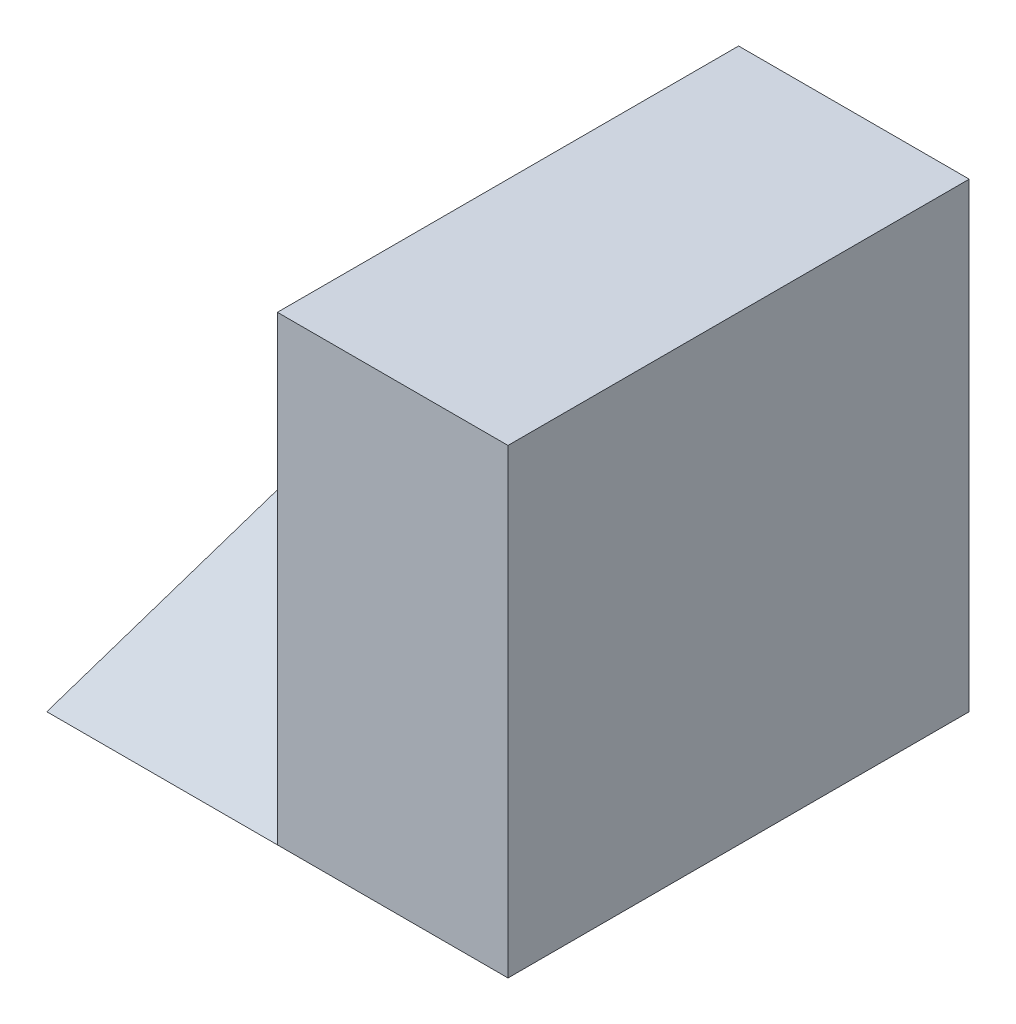
ISO-10303-21;
HEADER;
FILE_DESCRIPTION(('STEP AP214'),'2;1');
FILE_NAME('part.step','',(''),(''),'','','');
FILE_SCHEMA(('AUTOMOTIVE_DESIGN { 1 0 10303 214 1 1 1 1 }'));
ENDSEC;
DATA;
#1=APPLICATION_CONTEXT('core data for automotive mechanical design processes');
#2=APPLICATION_PROTOCOL_DEFINITION('international standard','automotive_design',2000,#1);
#3=PRODUCT_CONTEXT('',#1,'mechanical');
#4=PRODUCT('Part','Part','',(#3));
#5=PRODUCT_RELATED_PRODUCT_CATEGORY('part','',(#4));
#6=PRODUCT_DEFINITION_FORMATION('','',#4);
#7=PRODUCT_DEFINITION_CONTEXT('part definition',#1,'design');
#8=PRODUCT_DEFINITION('design','',#6,#7);
#9=PRODUCT_DEFINITION_SHAPE('','',#8);
#10=(LENGTH_UNIT() NAMED_UNIT(*) SI_UNIT(.MILLI.,.METRE.));
#11=(NAMED_UNIT(*) PLANE_ANGLE_UNIT() SI_UNIT($,.RADIAN.));
#12=(NAMED_UNIT(*) SI_UNIT($,.STERADIAN.) SOLID_ANGLE_UNIT());
#13=UNCERTAINTY_MEASURE_WITH_UNIT(LENGTH_MEASURE(1.E-05),#10,'distance_accuracy_value','');
#14=(GEOMETRIC_REPRESENTATION_CONTEXT(3) GLOBAL_UNCERTAINTY_ASSIGNED_CONTEXT((#13)) GLOBAL_UNIT_ASSIGNED_CONTEXT((#10,
#11,#12)) REPRESENTATION_CONTEXT('',''));
#15=CARTESIAN_POINT('',(0.,0.,0.));
#16=DIRECTION('',(0.,0.,1.));
#17=DIRECTION('',(1.,0.,0.));
#18=AXIS2_PLACEMENT_3D('',#15,#16,#17);
#19=CARTESIAN_POINT('',(20.,40.,20.));
#20=DIRECTION('',(1.,0.,0.));
#21=DIRECTION('',(0.,0.,-1.));
#22=AXIS2_PLACEMENT_3D('',#19,#20,#21);
#23=PLANE('',#22);
#24=DIRECTION('',(0.,0.707106781186548,-0.707106781186548));
#25=VECTOR('',#24,1.);
#26=CARTESIAN_POINT('',(20.,40.,0.));
#27=LINE('',#26,#25);
#28=CARTESIAN_POINT('',(20.,0.,40.));
#29=VERTEX_POINT('',#28);
#30=CARTESIAN_POINT('',(20.,40.,0.));
#31=VERTEX_POINT('',#30);
#32=EDGE_CURVE('E93',#29,#31,#27,.T.);
#33=ORIENTED_EDGE('',*,*,#32,.F.);
#34=DIRECTION('',(0.,1.,0.));
#35=VECTOR('',#34,1.);
#36=CARTESIAN_POINT('',(20.,40.,40.));
#37=LINE('',#36,#35);
#38=CARTESIAN_POINT('',(20.,40.,40.));
#39=VERTEX_POINT('',#38);
#40=EDGE_CURVE('E108',#29,#39,#37,.T.);
#41=ORIENTED_EDGE('',*,*,#40,.T.);
#42=DIRECTION('',(0.,0.,1.));
#43=VECTOR('',#42,1.);
#44=CARTESIAN_POINT('',(20.,40.,0.));
#45=LINE('',#44,#43);
#46=EDGE_CURVE('E69',#31,#39,#45,.T.);
#47=ORIENTED_EDGE('',*,*,#46,.F.);
#48=EDGE_LOOP('',(#33,#41,#47));
#49=FACE_BOUND('',#48,.T.);
#50=ADVANCED_FACE('F33',(#49),#23,.F.);
#51=CARTESIAN_POINT('',(0.,0.,40.));
#52=DIRECTION('',(0.,1.,0.));
#53=DIRECTION('',(0.,0.,1.));
#54=AXIS2_PLACEMENT_3D('',#51,#52,#53);
#55=PLANE('',#54);
#56=DIRECTION('',(1.,0.,0.));
#57=VECTOR('',#56,1.);
#58=CARTESIAN_POINT('',(0.,0.,40.));
#59=LINE('',#58,#57);
#60=CARTESIAN_POINT('',(40.,0.,40.));
#61=VERTEX_POINT('',#60);
#62=EDGE_CURVE('E103',#29,#61,#59,.T.);
#63=ORIENTED_EDGE('',*,*,#62,.F.);
#64=DIRECTION('',(1.,0.,0.));
#65=VECTOR('',#64,1.);
#66=CARTESIAN_POINT('',(0.,0.,40.));
#67=LINE('',#66,#65);
#68=CARTESIAN_POINT('',(0.,0.,40.));
#69=VERTEX_POINT('',#68);
#70=EDGE_CURVE('E111',#69,#29,#67,.T.);
#71=ORIENTED_EDGE('',*,*,#70,.F.);
#72=DIRECTION('',(0.,0.,1.));
#73=VECTOR('',#72,1.);
#74=CARTESIAN_POINT('',(0.,0.,40.));
#75=LINE('',#74,#73);
#76=CARTESIAN_POINT('',(0.,0.,0.));
#77=VERTEX_POINT('',#76);
#78=EDGE_CURVE('E88',#77,#69,#75,.T.);
#79=ORIENTED_EDGE('',*,*,#78,.F.);
#80=DIRECTION('',(1.,0.,0.));
#81=VECTOR('',#80,1.);
#82=CARTESIAN_POINT('',(0.,0.,0.));
#83=LINE('',#82,#81);
#84=CARTESIAN_POINT('',(40.,0.,0.));
#85=VERTEX_POINT('',#84);
#86=EDGE_CURVE('E61',#77,#85,#83,.T.);
#87=ORIENTED_EDGE('',*,*,#86,.T.);
#88=DIRECTION('',(0.,0.,-1.));
#89=VECTOR('',#88,1.);
#90=CARTESIAN_POINT('',(40.,0.,40.));
#91=LINE('',#90,#89);
#92=EDGE_CURVE('E11',#61,#85,#91,.T.);
#93=ORIENTED_EDGE('',*,*,#92,.F.);
#94=EDGE_LOOP('',(#63,#71,#79,#87,#93));
#95=FACE_BOUND('',#94,.T.);
#96=ADVANCED_FACE('F35',(#95),#55,.F.);
#97=CARTESIAN_POINT('',(40.,0.,40.));
#98=DIRECTION('',(-1.,0.,0.));
#99=DIRECTION('',(0.,0.,1.));
#100=AXIS2_PLACEMENT_3D('',#97,#98,#99);
#101=PLANE('',#100);
#102=DIRECTION('',(0.,1.,0.));
#103=VECTOR('',#102,1.);
#104=CARTESIAN_POINT('',(40.,0.,0.));
#105=LINE('',#104,#103);
#106=CARTESIAN_POINT('',(40.,40.,0.));
#107=VERTEX_POINT('',#106);
#108=EDGE_CURVE('E104',#85,#107,#105,.T.);
#109=ORIENTED_EDGE('',*,*,#108,.T.);
#110=DIRECTION('',(0.,0.,-1.));
#111=VECTOR('',#110,1.);
#112=CARTESIAN_POINT('',(40.,40.,40.));
#113=LINE('',#112,#111);
#114=CARTESIAN_POINT('',(40.,40.,40.));
#115=VERTEX_POINT('',#114);
#116=EDGE_CURVE('E42',#115,#107,#113,.T.);
#117=ORIENTED_EDGE('',*,*,#116,.F.);
#118=DIRECTION('',(0.,1.,0.));
#119=VECTOR('',#118,1.);
#120=CARTESIAN_POINT('',(40.,0.,40.));
#121=LINE('',#120,#119);
#122=EDGE_CURVE('E50',#61,#115,#121,.T.);
#123=ORIENTED_EDGE('',*,*,#122,.F.);
#124=ORIENTED_EDGE('',*,*,#92,.T.);
#125=EDGE_LOOP('',(#109,#117,#123,#124));
#126=FACE_BOUND('',#125,.T.);
#127=ADVANCED_FACE('F123',(#126),#101,.F.);
#128=CARTESIAN_POINT('',(0.,40.,40.));
#129=DIRECTION('',(0.,-1.,0.));
#130=DIRECTION('',(0.,0.,-1.));
#131=AXIS2_PLACEMENT_3D('',#128,#129,#130);
#132=PLANE('',#131);
#133=DIRECTION('',(-1.,0.,0.));
#134=VECTOR('',#133,1.);
#135=CARTESIAN_POINT('',(0.,40.,0.));
#136=LINE('',#135,#134);
#137=EDGE_CURVE('E99',#107,#31,#136,.T.);
#138=ORIENTED_EDGE('',*,*,#137,.T.);
#139=ORIENTED_EDGE('',*,*,#46,.T.);
#140=DIRECTION('',(-1.,0.,0.));
#141=VECTOR('',#140,1.);
#142=CARTESIAN_POINT('',(0.,40.,40.));
#143=LINE('',#142,#141);
#144=EDGE_CURVE('E119',#115,#39,#143,.T.);
#145=ORIENTED_EDGE('',*,*,#144,.F.);
#146=ORIENTED_EDGE('',*,*,#116,.T.);
#147=EDGE_LOOP('',(#138,#139,#145,#146));
#148=FACE_BOUND('',#147,.T.);
#149=ADVANCED_FACE('F102',(#148),#132,.F.);
#150=CARTESIAN_POINT('',(0.,0.,40.));
#151=DIRECTION('',(0.,0.,-1.));
#152=DIRECTION('',(-1.,0.,0.));
#153=AXIS2_PLACEMENT_3D('',#150,#151,#152);
#154=PLANE('',#153);
#155=ORIENTED_EDGE('',*,*,#144,.T.);
#156=ORIENTED_EDGE('',*,*,#40,.F.);
#157=ORIENTED_EDGE('',*,*,#62,.T.);
#158=ORIENTED_EDGE('',*,*,#122,.T.);
#159=EDGE_LOOP('',(#155,#156,#157,#158));
#160=FACE_BOUND('',#159,.T.);
#161=ADVANCED_FACE('F125',(#160),#154,.F.);
#162=CARTESIAN_POINT('',(0.,0.,0.));
#163=DIRECTION('',(0.,0.,-1.));
#164=DIRECTION('',(-1.,0.,0.));
#165=AXIS2_PLACEMENT_3D('',#162,#163,#164);
#166=PLANE('',#165);
#167=DIRECTION('',(-0.447213595499958,-0.894427190999916,0.));
#168=VECTOR('',#167,1.);
#169=CARTESIAN_POINT('',(0.,0.,0.));
#170=LINE('',#169,#168);
#171=EDGE_CURVE('E87',#31,#77,#170,.T.);
#172=ORIENTED_EDGE('',*,*,#171,.F.);
#173=ORIENTED_EDGE('',*,*,#137,.F.);
#174=ORIENTED_EDGE('',*,*,#108,.F.);
#175=ORIENTED_EDGE('',*,*,#86,.F.);
#176=EDGE_LOOP('',(#172,#173,#174,#175));
#177=FACE_BOUND('',#176,.T.);
#178=ADVANCED_FACE('F97',(#177),#166,.T.);
#179=CARTESIAN_POINT('',(0.,40.,0.));
#180=DIRECTION('',(0.,-0.707106781186548,-0.707106781186548));
#181=DIRECTION('',(0.,0.707106781186548,-0.707106781186548));
#182=AXIS2_PLACEMENT_3D('',#179,#180,#181);
#183=PLANE('',#182);
#184=ORIENTED_EDGE('',*,*,#32,.T.);
#185=DIRECTION('',(-0.333333333333333,-0.666666666666667,0.666666666666667));
#186=VECTOR('',#185,1.);
#187=CARTESIAN_POINT('',(17.7777777777778,35.5555555555556,4.44444444444445));
#188=LINE('',#187,#186);
#189=EDGE_CURVE('E84',#31,#69,#188,.T.);
#190=ORIENTED_EDGE('',*,*,#189,.T.);
#191=ORIENTED_EDGE('',*,*,#70,.T.);
#192=EDGE_LOOP('',(#184,#190,#191));
#193=FACE_BOUND('',#192,.T.);
#194=ADVANCED_FACE('F110',(#193),#183,.F.);
#195=CARTESIAN_POINT('',(0.,0.,50.));
#196=DIRECTION('',(0.894427190999916,-0.447213595499958,0.));
#197=DIRECTION('',(0.447213595499958,0.894427190999916,0.));
#198=AXIS2_PLACEMENT_3D('',#195,#196,#197);
#199=PLANE('',#198);
#200=ORIENTED_EDGE('',*,*,#171,.T.);
#201=ORIENTED_EDGE('',*,*,#78,.T.);
#202=ORIENTED_EDGE('',*,*,#189,.F.);
#203=EDGE_LOOP('',(#200,#201,#202));
#204=FACE_BOUND('',#203,.T.);
#205=ADVANCED_FACE('F86',(#204),#199,.F.);
#206=CLOSED_SHELL('',(#50,#96,#127,#149,#161,#178,#194,#205));
#207=MANIFOLD_SOLID_BREP('B2',#206);
#208=ADVANCED_BREP_SHAPE_REPRESENTATION('',(#18,#207),#14);
#209=SHAPE_DEFINITION_REPRESENTATION(#9,#208);
ENDSEC;
END-ISO-10303-21;
